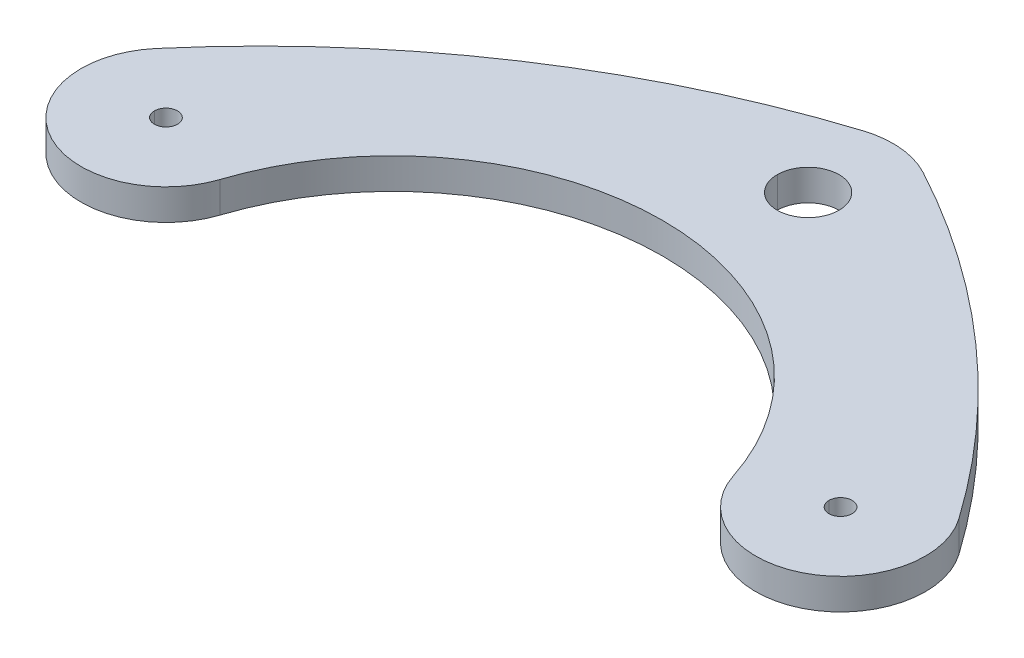
ISO-10303-21;
HEADER;
FILE_DESCRIPTION(('STEP AP214'),'2;1');
FILE_NAME('part.step','',(''),(''),'','','');
FILE_SCHEMA(('AUTOMOTIVE_DESIGN { 1 0 10303 214 1 1 1 1 }'));
ENDSEC;
DATA;
#1=APPLICATION_CONTEXT('core data for automotive mechanical design processes');
#2=APPLICATION_PROTOCOL_DEFINITION('international standard','automotive_design',2000,#1);
#3=PRODUCT_CONTEXT('',#1,'mechanical');
#4=PRODUCT('Part','Part','',(#3));
#5=PRODUCT_RELATED_PRODUCT_CATEGORY('part','',(#4));
#6=PRODUCT_DEFINITION_FORMATION('','',#4);
#7=PRODUCT_DEFINITION_CONTEXT('part definition',#1,'design');
#8=PRODUCT_DEFINITION('design','',#6,#7);
#9=PRODUCT_DEFINITION_SHAPE('','',#8);
#10=(LENGTH_UNIT() NAMED_UNIT(*) SI_UNIT(.MILLI.,.METRE.));
#11=(NAMED_UNIT(*) PLANE_ANGLE_UNIT() SI_UNIT($,.RADIAN.));
#12=(NAMED_UNIT(*) SI_UNIT($,.STERADIAN.) SOLID_ANGLE_UNIT());
#13=UNCERTAINTY_MEASURE_WITH_UNIT(LENGTH_MEASURE(1.E-05),#10,'distance_accuracy_value','');
#14=(GEOMETRIC_REPRESENTATION_CONTEXT(3) GLOBAL_UNCERTAINTY_ASSIGNED_CONTEXT((#13)) GLOBAL_UNIT_ASSIGNED_CONTEXT((#10,
#11,#12)) REPRESENTATION_CONTEXT('',''));
#15=CARTESIAN_POINT('',(0.,0.,0.));
#16=DIRECTION('',(0.,0.,1.));
#17=DIRECTION('',(1.,0.,0.));
#18=AXIS2_PLACEMENT_3D('',#15,#16,#17);
#19=CARTESIAN_POINT('',(24.1341268046564,-14.6000000000352,33.3708932983595));
#20=DIRECTION('',(3.23999160833921E-12,-1.,8.97471333360938E-13));
#21=DIRECTION('',(0.,-8.97471333360938E-13,-1.));
#22=AXIS2_PLACEMENT_3D('',#19,#20,#21);
#23=PLANE('',#22);
#24=CARTESIAN_POINT('',(87.3999999999932,-14.5999999998435,18.5999999999982));
#25=DIRECTION('',(3.24046345312468E-12,-1.,8.97471333360938E-13));
#26=DIRECTION('',(1.,3.24046345312468E-12,0.));
#27=AXIS2_PLACEMENT_3D('',#24,#25,#26);
#28=CIRCLE('',#27,1.5);
#29=CARTESIAN_POINT('',(85.8999999999932,-14.5999999998483,18.6));
#30=VERTEX_POINT('',#29);
#31=CARTESIAN_POINT('',(88.8999999999932,-14.5999999998386,18.6));
#32=VERTEX_POINT('',#31);
#33=EDGE_CURVE('E268',#30,#32,#28,.T.);
#34=ORIENTED_EDGE('',*,*,#33,.T.);
#35=CARTESIAN_POINT('',(87.3999999999932,-14.5999999998435,18.5999999999982));
#36=DIRECTION('',(3.24046345312468E-12,-1.,8.97471333360938E-13));
#37=DIRECTION('',(1.,3.24046345312468E-12,0.));
#38=AXIS2_PLACEMENT_3D('',#35,#36,#37);
#39=CIRCLE('',#38,1.5);
#40=EDGE_CURVE('E11',#32,#30,#39,.T.);
#41=ORIENTED_EDGE('',*,*,#40,.T.);
#42=EDGE_LOOP('',(#34,#41));
#43=FACE_BOUND('',#42,.T.);
#44=CARTESIAN_POINT('',(49.9999999999932,-14.5999999999944,-14.6000000000017));
#45=DIRECTION('',(3.24002977225569E-12,-1.,8.97471333360938E-13));
#46=DIRECTION('',(1.,3.24002977225569E-12,0.));
#47=AXIS2_PLACEMENT_3D('',#44,#45,#46);
#48=CIRCLE('',#47,4.);
#49=CARTESIAN_POINT('',(45.9999999999932,-14.6000000000074,-14.6));
#50=VERTEX_POINT('',#49);
#51=CARTESIAN_POINT('',(53.9999999999932,-14.5999999999815,-14.6));
#52=VERTEX_POINT('',#51);
#53=EDGE_CURVE('E180',#50,#52,#48,.T.);
#54=ORIENTED_EDGE('',*,*,#53,.T.);
#55=CARTESIAN_POINT('',(49.9999999999932,-14.5999999999944,-14.6000000000017));
#56=DIRECTION('',(3.24002977225569E-12,-1.,8.97471333360938E-13));
#57=DIRECTION('',(1.,3.24002977225569E-12,0.));
#58=AXIS2_PLACEMENT_3D('',#55,#56,#57);
#59=CIRCLE('',#58,4.);
#60=EDGE_CURVE('E172',#52,#50,#59,.T.);
#61=ORIENTED_EDGE('',*,*,#60,.T.);
#62=EDGE_LOOP('',(#54,#61));
#63=FACE_BOUND('',#62,.T.);
#64=CARTESIAN_POINT('',(-6.78623823802127E-12,-14.6000000001266,18.5999999999982));
#65=DIRECTION('',(3.24046345312468E-12,-1.,8.97471333360938E-13));
#66=DIRECTION('',(1.,3.24046345312468E-12,0.));
#67=AXIS2_PLACEMENT_3D('',#64,#65,#66);
#68=CIRCLE('',#67,1.5);
#69=CARTESIAN_POINT('',(-1.50000000000679,-14.6000000001315,18.6));
#70=VERTEX_POINT('',#69);
#71=CARTESIAN_POINT('',(1.49999999999321,-14.6000000001218,18.6));
#72=VERTEX_POINT('',#71);
#73=EDGE_CURVE('E242',#70,#72,#68,.T.);
#74=ORIENTED_EDGE('',*,*,#73,.T.);
#75=CARTESIAN_POINT('',(-6.78623823802127E-12,-14.6000000001266,18.5999999999982));
#76=DIRECTION('',(3.24046345312468E-12,-1.,8.97471333360938E-13));
#77=DIRECTION('',(1.,3.24046345312468E-12,0.));
#78=AXIS2_PLACEMENT_3D('',#75,#76,#77);
#79=CIRCLE('',#78,1.5);
#80=EDGE_CURVE('E178',#72,#70,#79,.T.);
#81=ORIENTED_EDGE('',*,*,#80,.T.);
#82=EDGE_LOOP('',(#74,#81));
#83=FACE_BOUND('',#82,.T.);
#84=CARTESIAN_POINT('',(49.9999999999932,-14.5999999999944,-14.6000000000017));
#85=DIRECTION('',(3.23999034672214E-12,-1.,8.97471333360938E-13));
#86=DIRECTION('',(1.,3.23999034672214E-12,0.));
#87=AXIS2_PLACEMENT_3D('',#84,#85,#86);
#88=CIRCLE('',#87,11.);
#89=CARTESIAN_POINT('',(46.6733135475964,-14.6000000000146,-25.0849013942658));
#90=VERTEX_POINT('',#89);
#91=CARTESIAN_POINT('',(55.2206349568502,-14.5999999999862,-24.2821986473774));
#92=VERTEX_POINT('',#91);
#93=EDGE_CURVE('E195',#90,#92,#88,.T.);
#94=ORIENTED_EDGE('',*,*,#93,.F.);
#95=CARTESIAN_POINT('',(82.9644384828343,-14.5999999997944,89.2958410886144));
#96=DIRECTION('',(3.23998640416878E-12,-1.,8.97471333360938E-13));
#97=DIRECTION('',(1.,3.23998640416878E-12,0.));
#98=AXIS2_PLACEMENT_3D('',#95,#96,#97);
#99=CIRCLE('',#98,120.);
#100=CARTESIAN_POINT('',(-8.37255801203662,-14.6000000001602,11.4655573213306));
#101=VERTEX_POINT('',#100);
#102=EDGE_CURVE('E203',#101,#90,#99,.T.);
#103=ORIENTED_EDGE('',*,*,#102,.F.);
#104=CARTESIAN_POINT('',(-6.78623823802127E-12,-14.6000000001266,18.5999999999982));
#105=DIRECTION('',(3.23999034672214E-12,-1.,8.97471333360938E-13));
#106=DIRECTION('',(1.,3.23999034672213E-12,0.));
#107=AXIS2_PLACEMENT_3D('',#104,#105,#106);
#108=CIRCLE('',#107,11.);
#109=CARTESIAN_POINT('',(-11.0000000000068,-14.6000000001623,18.6));
#110=VERTEX_POINT('',#109);
#111=EDGE_CURVE('E190',#110,#101,#108,.T.);
#112=ORIENTED_EDGE('',*,*,#111,.F.);
#113=CARTESIAN_POINT('',(-6.78623823802127E-12,-14.6000000001266,18.5999999999982));
#114=DIRECTION('',(3.23999034672214E-12,-1.,8.97471333360938E-13));
#115=DIRECTION('',(1.,3.23999034672213E-12,0.));
#116=AXIS2_PLACEMENT_3D('',#113,#114,#115);
#117=CIRCLE('',#116,11.);
#118=CARTESIAN_POINT('',(10.4499999999932,-14.6000000000897,22.0347488991173));
#119=VERTEX_POINT('',#118);
#120=EDGE_CURVE('E54',#119,#110,#117,.T.);
#121=ORIENTED_EDGE('',*,*,#120,.F.);
#122=CARTESIAN_POINT('',(43.6999999999932,-14.5999999999722,32.9634953963145));
#123=DIRECTION('',(-3.23996781784583E-12,1.,-8.97471333360938E-13));
#124=DIRECTION('',(1.,3.23996781784583E-12,0.));
#125=AXIS2_PLACEMENT_3D('',#122,#123,#124);
#126=CIRCLE('',#125,35.);
#127=CARTESIAN_POINT('',(76.9499999999932,-14.5999999998742,22.0347488991173));
#128=VERTEX_POINT('',#127);
#129=EDGE_CURVE('E135',#128,#119,#126,.T.);
#130=ORIENTED_EDGE('',*,*,#129,.F.);
#131=CARTESIAN_POINT('',(87.3999999999932,-14.5999999998435,18.5999999999982));
#132=DIRECTION('',(3.23999034672214E-12,-1.,8.97471333360938E-13));
#133=DIRECTION('',(1.,3.23999034672214E-12,0.));
#134=AXIS2_PLACEMENT_3D('',#131,#132,#133);
#135=CIRCLE('',#134,11.);
#136=CARTESIAN_POINT('',(96.3949468834557,-14.59999999982,12.2682600682189));
#137=VERTEX_POINT('',#136);
#138=EDGE_CURVE('E128',#137,#128,#135,.T.);
#139=ORIENTED_EDGE('',*,*,#138,.F.);
#140=CARTESIAN_POINT('',(-1.73174639068027,-14.6000000000759,81.3417865967207));
#141=DIRECTION('',(3.23998640416879E-12,-1.,8.97471333360938E-13));
#142=DIRECTION('',(1.,3.23998640416879E-12,0.));
#143=AXIS2_PLACEMENT_3D('',#140,#141,#142);
#144=CIRCLE('',#143,120.);
#145=EDGE_CURVE('E132',#92,#137,#144,.T.);
#146=ORIENTED_EDGE('',*,*,#145,.F.);
#147=EDGE_LOOP('',(#94,#103,#112,#121,#130,#139,#146));
#148=FACE_BOUND('',#147,.T.);
#149=ADVANCED_FACE('F16',(#43,#63,#83,#148),#23,.F.);
#150=CARTESIAN_POINT('',(24.1341268046694,-18.6000000000352,33.3708932983631));
#151=DIRECTION('',(3.23999160833921E-12,-1.,8.97471333360938E-13));
#152=DIRECTION('',(0.,-8.97471333360938E-13,-1.));
#153=AXIS2_PLACEMENT_3D('',#150,#151,#152);
#154=PLANE('',#153);
#155=CARTESIAN_POINT('',(87.4000000000062,-18.5999999998435,18.6000000000018));
#156=DIRECTION('',(3.24046345312468E-12,-1.,8.97471333360938E-13));
#157=DIRECTION('',(1.,3.24046345312468E-12,0.));
#158=AXIS2_PLACEMENT_3D('',#155,#156,#157);
#159=CIRCLE('',#158,1.5);
#160=CARTESIAN_POINT('',(85.9000000000062,-18.5999999998484,18.6));
#161=VERTEX_POINT('',#160);
#162=CARTESIAN_POINT('',(88.9000000000062,-18.5999999998386,18.6));
#163=VERTEX_POINT('',#162);
#164=EDGE_CURVE('E217',#161,#163,#159,.T.);
#165=ORIENTED_EDGE('',*,*,#164,.F.);
#166=CARTESIAN_POINT('',(87.4000000000062,-18.5999999998435,18.6000000000018));
#167=DIRECTION('',(3.24046345312468E-12,-1.,8.97471333360938E-13));
#168=DIRECTION('',(1.,3.24046345312468E-12,0.));
#169=AXIS2_PLACEMENT_3D('',#166,#167,#168);
#170=CIRCLE('',#169,1.5);
#171=EDGE_CURVE('E26',#163,#161,#170,.T.);
#172=ORIENTED_EDGE('',*,*,#171,.F.);
#173=EDGE_LOOP('',(#165,#172));
#174=FACE_BOUND('',#173,.T.);
#175=CARTESIAN_POINT('',(50.0000000000062,-18.5999999999945,-14.5999999999981));
#176=DIRECTION('',(3.23959609138669E-12,-1.,8.97471333360938E-13));
#177=DIRECTION('',(1.,3.23959609138669E-12,0.));
#178=AXIS2_PLACEMENT_3D('',#175,#176,#177);
#179=CIRCLE('',#178,4.);
#180=CARTESIAN_POINT('',(46.0000000000062,-18.6000000000074,-14.6));
#181=VERTEX_POINT('',#180);
#182=CARTESIAN_POINT('',(54.0000000000062,-18.5999999999815,-14.6));
#183=VERTEX_POINT('',#182);
#184=EDGE_CURVE('E261',#181,#183,#179,.T.);
#185=ORIENTED_EDGE('',*,*,#184,.F.);
#186=CARTESIAN_POINT('',(50.0000000000062,-18.5999999999945,-14.5999999999981));
#187=DIRECTION('',(3.23959609138669E-12,-1.,8.97471333360938E-13));
#188=DIRECTION('',(1.,3.23959609138669E-12,0.));
#189=AXIS2_PLACEMENT_3D('',#186,#187,#188);
#190=CIRCLE('',#189,4.);
#191=EDGE_CURVE('E176',#183,#181,#190,.T.);
#192=ORIENTED_EDGE('',*,*,#191,.F.);
#193=EDGE_LOOP('',(#185,#192));
#194=FACE_BOUND('',#193,.T.);
#195=CARTESIAN_POINT('',(6.17383921763803E-12,-18.6000000001266,18.6000000000018));
#196=DIRECTION('',(3.24046345312468E-12,-1.,8.97471333360938E-13));
#197=DIRECTION('',(1.,3.24046345312468E-12,0.));
#198=AXIS2_PLACEMENT_3D('',#195,#196,#197);
#199=CIRCLE('',#198,1.5);
#200=CARTESIAN_POINT('',(-1.49999999999383,-18.6000000001315,18.6));
#201=VERTEX_POINT('',#200);
#202=CARTESIAN_POINT('',(1.50000000000618,-18.6000000001218,18.6));
#203=VERTEX_POINT('',#202);
#204=EDGE_CURVE('E222',#201,#203,#199,.T.);
#205=ORIENTED_EDGE('',*,*,#204,.F.);
#206=CARTESIAN_POINT('',(6.17383921763803E-12,-18.6000000001266,18.6000000000018));
#207=DIRECTION('',(3.24046345312468E-12,-1.,8.97471333360938E-13));
#208=DIRECTION('',(1.,3.24046345312468E-12,0.));
#209=AXIS2_PLACEMENT_3D('',#206,#207,#208);
#210=CIRCLE('',#209,1.5);
#211=EDGE_CURVE('E175',#203,#201,#210,.T.);
#212=ORIENTED_EDGE('',*,*,#211,.F.);
#213=EDGE_LOOP('',(#205,#212));
#214=FACE_BOUND('',#213,.T.);
#215=CARTESIAN_POINT('',(50.0000000000062,-18.5999999999945,-14.5999999999981));
#216=DIRECTION('',(3.24014804885632E-12,-1.,8.97471333360938E-13));
#217=DIRECTION('',(1.,3.24014804885632E-12,0.));
#218=AXIS2_PLACEMENT_3D('',#215,#216,#217);
#219=CIRCLE('',#218,11.);
#220=CARTESIAN_POINT('',(46.6733135476094,-18.6000000000146,-25.0849013942622));
#221=VERTEX_POINT('',#220);
#222=CARTESIAN_POINT('',(55.2206349568632,-18.5999999999862,-24.2821986473738));
#223=VERTEX_POINT('',#222);
#224=EDGE_CURVE('E164',#221,#223,#219,.T.);
#225=ORIENTED_EDGE('',*,*,#224,.T.);
#226=CARTESIAN_POINT('',(-1.7317463906673,-18.6000000000759,81.3417865967243));
#227=DIRECTION('',(3.24000086019775E-12,-1.,8.97471333360938E-13));
#228=DIRECTION('',(1.,3.24000086019775E-12,0.));
#229=AXIS2_PLACEMENT_3D('',#226,#227,#228);
#230=CIRCLE('',#229,120.);
#231=CARTESIAN_POINT('',(96.3949468834687,-18.59999999982,12.2682600682225));
#232=VERTEX_POINT('',#231);
#233=EDGE_CURVE('E141',#223,#232,#230,.T.);
#234=ORIENTED_EDGE('',*,*,#233,.T.);
#235=CARTESIAN_POINT('',(87.4000000000062,-18.5999999998435,18.6000000000018));
#236=DIRECTION('',(3.24014804885632E-12,-1.,8.97471333360938E-13));
#237=DIRECTION('',(1.,3.24014804885632E-12,0.));
#238=AXIS2_PLACEMENT_3D('',#235,#236,#237);
#239=CIRCLE('',#238,11.);
#240=CARTESIAN_POINT('',(76.9500000000062,-18.5999999998743,22.034748899121));
#241=VERTEX_POINT('',#240);
#242=EDGE_CURVE('E147',#232,#241,#239,.T.);
#243=ORIENTED_EDGE('',*,*,#242,.T.);
#244=CARTESIAN_POINT('',(43.7000000000061,-18.5999999999722,32.9634953963181));
#245=DIRECTION('',(-3.23996781784583E-12,1.,-8.97471333360938E-13));
#246=DIRECTION('',(1.,3.23996781784583E-12,0.));
#247=AXIS2_PLACEMENT_3D('',#244,#245,#246);
#248=CIRCLE('',#247,35.);
#249=CARTESIAN_POINT('',(10.4500000000062,-18.6000000000897,22.034748899121));
#250=VERTEX_POINT('',#249);
#251=EDGE_CURVE('E171',#241,#250,#248,.T.);
#252=ORIENTED_EDGE('',*,*,#251,.T.);
#253=CARTESIAN_POINT('',(6.17383921763803E-12,-18.6000000001266,18.6000000000018));
#254=DIRECTION('',(3.24014804885632E-12,-1.,8.97471333360938E-13));
#255=DIRECTION('',(1.,3.24014804885632E-12,0.));
#256=AXIS2_PLACEMENT_3D('',#253,#254,#255);
#257=CIRCLE('',#256,11.);
#258=CARTESIAN_POINT('',(-10.9999999999938,-18.6000000001623,18.6));
#259=VERTEX_POINT('',#258);
#260=EDGE_CURVE('E40',#250,#259,#257,.T.);
#261=ORIENTED_EDGE('',*,*,#260,.T.);
#262=CARTESIAN_POINT('',(6.17383921763803E-12,-18.6000000001266,18.6000000000018));
#263=DIRECTION('',(3.24014804885632E-12,-1.,8.97471333360938E-13));
#264=DIRECTION('',(1.,3.24014804885632E-12,0.));
#265=AXIS2_PLACEMENT_3D('',#262,#263,#264);
#266=CIRCLE('',#265,11.);
#267=CARTESIAN_POINT('',(-8.37255801202366,-18.6000000001601,11.4655573213342));
#268=VERTEX_POINT('',#267);
#269=EDGE_CURVE('E191',#259,#268,#266,.T.);
#270=ORIENTED_EDGE('',*,*,#269,.T.);
#271=CARTESIAN_POINT('',(82.9644384828473,-18.5999999997944,89.295841088618));
#272=DIRECTION('',(3.24000086019775E-12,-1.,8.97471333360938E-13));
#273=DIRECTION('',(1.,3.24000086019775E-12,0.));
#274=AXIS2_PLACEMENT_3D('',#271,#272,#273);
#275=CIRCLE('',#274,120.);
#276=EDGE_CURVE('E200',#268,#221,#275,.T.);
#277=ORIENTED_EDGE('',*,*,#276,.T.);
#278=EDGE_LOOP('',(#225,#234,#243,#252,#261,#270,#277));
#279=FACE_BOUND('',#278,.T.);
#280=ADVANCED_FACE('F283',(#174,#194,#214,#279),#154,.T.);
#281=CARTESIAN_POINT('',(87.4000000000062,-18.5999999998435,18.6000000000018));
#282=DIRECTION('',(-3.24046345312468E-12,1.,-8.97471333360938E-13));
#283=DIRECTION('',(-1.,-3.24046345312468E-12,0.));
#284=AXIS2_PLACEMENT_3D('',#281,#282,#283);
#285=CYLINDRICAL_SURFACE('',#284,1.5);
#286=DIRECTION('',(-3.24001936391482E-12,1.,-8.97471333360938E-13));
#287=VECTOR('',#286,1.);
#288=CARTESIAN_POINT('',(88.9000000000062,-18.5999999998386,18.6000000000018));
#289=LINE('',#288,#287);
#290=EDGE_CURVE('E221',#163,#32,#289,.T.);
#291=ORIENTED_EDGE('',*,*,#290,.F.);
#292=ORIENTED_EDGE('',*,*,#171,.T.);
#293=DIRECTION('',(-3.24001936391482E-12,1.,-8.97471333360938E-13));
#294=VECTOR('',#293,1.);
#295=CARTESIAN_POINT('',(85.9000000000062,-18.5999999998484,18.6000000000018));
#296=LINE('',#295,#294);
#297=EDGE_CURVE('E20',#161,#30,#296,.T.);
#298=ORIENTED_EDGE('',*,*,#297,.T.);
#299=ORIENTED_EDGE('',*,*,#40,.F.);
#300=EDGE_LOOP('',(#291,#292,#298,#299));
#301=FACE_BOUND('',#300,.T.);
#302=ADVANCED_FACE('F18',(#301),#285,.F.);
#303=CARTESIAN_POINT('',(82.9644384828473,-18.5999999997944,89.295841088618));
#304=DIRECTION('',(-3.24000086019775E-12,1.,-8.97471333360938E-13));
#305=DIRECTION('',(-1.,-3.24000086019775E-12,0.));
#306=AXIS2_PLACEMENT_3D('',#303,#304,#305);
#307=CYLINDRICAL_SURFACE('',#306,120.);
#308=ORIENTED_EDGE('',*,*,#102,.T.);
#309=DIRECTION('',(-3.24001936391482E-12,1.,-8.97471333360938E-13));
#310=VECTOR('',#309,1.);
#311=CARTESIAN_POINT('',(46.6733135476094,-18.6000000000146,-25.0849013942622));
#312=LINE('',#311,#310);
#313=EDGE_CURVE('E157',#221,#90,#312,.T.);
#314=ORIENTED_EDGE('',*,*,#313,.F.);
#315=ORIENTED_EDGE('',*,*,#276,.F.);
#316=DIRECTION('',(-3.24001936391482E-12,1.,-8.97471333360938E-13));
#317=VECTOR('',#316,1.);
#318=CARTESIAN_POINT('',(-8.37255801202366,-18.6000000001601,11.4655573213342));
#319=LINE('',#318,#317);
#320=EDGE_CURVE('E192',#268,#101,#319,.T.);
#321=ORIENTED_EDGE('',*,*,#320,.T.);
#322=EDGE_LOOP('',(#308,#314,#315,#321));
#323=FACE_BOUND('',#322,.T.);
#324=ADVANCED_FACE('F292',(#323),#307,.T.);
#325=CARTESIAN_POINT('',(6.17383921763803E-12,-18.6000000001266,18.6000000000018));
#326=DIRECTION('',(-3.24046345312468E-12,1.,-8.97471333360938E-13));
#327=DIRECTION('',(-1.,-3.24046345312468E-12,0.));
#328=AXIS2_PLACEMENT_3D('',#325,#326,#327);
#329=CYLINDRICAL_SURFACE('',#328,1.5);
#330=DIRECTION('',(-3.24001936391482E-12,1.,-8.97471333360938E-13));
#331=VECTOR('',#330,1.);
#332=CARTESIAN_POINT('',(1.50000000000618,-18.6000000001218,18.6000000000018));
#333=LINE('',#332,#331);
#334=EDGE_CURVE('E225',#203,#72,#333,.T.);
#335=ORIENTED_EDGE('',*,*,#334,.F.);
#336=ORIENTED_EDGE('',*,*,#211,.T.);
#337=DIRECTION('',(-3.24001936391482E-12,1.,-8.97471333360938E-13));
#338=VECTOR('',#337,1.);
#339=CARTESIAN_POINT('',(-1.49999999999383,-18.6000000001315,18.6000000000018));
#340=LINE('',#339,#338);
#341=EDGE_CURVE('E168',#201,#70,#340,.T.);
#342=ORIENTED_EDGE('',*,*,#341,.T.);
#343=ORIENTED_EDGE('',*,*,#80,.F.);
#344=EDGE_LOOP('',(#335,#336,#342,#343));
#345=FACE_BOUND('',#344,.T.);
#346=ADVANCED_FACE('F309',(#345),#329,.F.);
#347=CARTESIAN_POINT('',(50.0000000000062,-18.5999999999945,-14.5999999999981));
#348=DIRECTION('',(-3.23959609138669E-12,1.,-8.97471333360938E-13));
#349=DIRECTION('',(-1.,-3.23959609138669E-12,0.));
#350=AXIS2_PLACEMENT_3D('',#347,#348,#349);
#351=CYLINDRICAL_SURFACE('',#350,4.);
#352=DIRECTION('',(-3.24001936391482E-12,1.,-8.97471333360938E-13));
#353=VECTOR('',#352,1.);
#354=CARTESIAN_POINT('',(54.0000000000062,-18.5999999999815,-14.5999999999981));
#355=LINE('',#354,#353);
#356=EDGE_CURVE('E185',#183,#52,#355,.T.);
#357=ORIENTED_EDGE('',*,*,#356,.F.);
#358=ORIENTED_EDGE('',*,*,#191,.T.);
#359=DIRECTION('',(-3.24001936391482E-12,1.,-8.97471333360938E-13));
#360=VECTOR('',#359,1.);
#361=CARTESIAN_POINT('',(46.0000000000062,-18.6000000000074,-14.5999999999981));
#362=LINE('',#361,#360);
#363=EDGE_CURVE('E184',#181,#50,#362,.T.);
#364=ORIENTED_EDGE('',*,*,#363,.T.);
#365=ORIENTED_EDGE('',*,*,#60,.F.);
#366=EDGE_LOOP('',(#357,#358,#364,#365));
#367=FACE_BOUND('',#366,.T.);
#368=ADVANCED_FACE('F560',(#367),#351,.F.);
#369=CARTESIAN_POINT('',(6.17383921763803E-12,-18.6000000001266,18.6000000000018));
#370=DIRECTION('',(-3.24014804885632E-12,1.,-8.97471333360938E-13));
#371=DIRECTION('',(-1.,-3.24014804885632E-12,0.));
#372=AXIS2_PLACEMENT_3D('',#369,#370,#371);
#373=CYLINDRICAL_SURFACE('',#372,11.);
#374=DIRECTION('',(-3.24001936391482E-12,1.,-8.97471333360938E-13));
#375=VECTOR('',#374,1.);
#376=CARTESIAN_POINT('',(-10.9999999999938,-18.6000000001623,18.6000000000018));
#377=LINE('',#376,#375);
#378=EDGE_CURVE('E186',#259,#110,#377,.T.);
#379=ORIENTED_EDGE('',*,*,#378,.F.);
#380=ORIENTED_EDGE('',*,*,#260,.F.);
#381=DIRECTION('',(-3.24001936391482E-12,1.,-8.97471333360938E-13));
#382=VECTOR('',#381,1.);
#383=CARTESIAN_POINT('',(10.4500000000062,-18.6000000000897,22.034748899121));
#384=LINE('',#383,#382);
#385=EDGE_CURVE('E199',#250,#119,#384,.T.);
#386=ORIENTED_EDGE('',*,*,#385,.T.);
#387=ORIENTED_EDGE('',*,*,#120,.T.);
#388=EDGE_LOOP('',(#379,#380,#386,#387));
#389=FACE_BOUND('',#388,.T.);
#390=ADVANCED_FACE('F355',(#389),#373,.T.);
#391=CARTESIAN_POINT('',(43.7000000000061,-18.5999999999722,32.9634953963181));
#392=DIRECTION('',(-3.23996781784583E-12,1.,-8.97471333360938E-13));
#393=DIRECTION('',(-1.,-3.23996781784583E-12,0.));
#394=AXIS2_PLACEMENT_3D('',#391,#392,#393);
#395=CYLINDRICAL_SURFACE('',#394,35.);
#396=ORIENTED_EDGE('',*,*,#129,.T.);
#397=ORIENTED_EDGE('',*,*,#385,.F.);
#398=ORIENTED_EDGE('',*,*,#251,.F.);
#399=DIRECTION('',(-3.24001936391482E-12,1.,-8.97471333360938E-13));
#400=VECTOR('',#399,1.);
#401=CARTESIAN_POINT('',(76.9500000000062,-18.5999999998743,22.034748899121));
#402=LINE('',#401,#400);
#403=EDGE_CURVE('E140',#241,#128,#402,.T.);
#404=ORIENTED_EDGE('',*,*,#403,.T.);
#405=EDGE_LOOP('',(#396,#397,#398,#404));
#406=FACE_BOUND('',#405,.T.);
#407=ADVANCED_FACE('F281',(#406),#395,.F.);
#408=CARTESIAN_POINT('',(87.4000000000062,-18.5999999998435,18.6000000000018));
#409=DIRECTION('',(-3.24014804885632E-12,1.,-8.97471333360938E-13));
#410=DIRECTION('',(-1.,-3.24014804885632E-12,0.));
#411=AXIS2_PLACEMENT_3D('',#408,#409,#410);
#412=CYLINDRICAL_SURFACE('',#411,11.);
#413=ORIENTED_EDGE('',*,*,#138,.T.);
#414=ORIENTED_EDGE('',*,*,#403,.F.);
#415=ORIENTED_EDGE('',*,*,#242,.F.);
#416=DIRECTION('',(-3.24001936391482E-12,1.,-8.97471333360938E-13));
#417=VECTOR('',#416,1.);
#418=CARTESIAN_POINT('',(96.3949468834687,-18.59999999982,12.2682600682225));
#419=LINE('',#418,#417);
#420=EDGE_CURVE('E144',#232,#137,#419,.T.);
#421=ORIENTED_EDGE('',*,*,#420,.T.);
#422=EDGE_LOOP('',(#413,#414,#415,#421));
#423=FACE_BOUND('',#422,.T.);
#424=ADVANCED_FACE('F145',(#423),#412,.T.);
#425=CARTESIAN_POINT('',(-1.7317463906673,-18.6000000000759,81.3417865967243));
#426=DIRECTION('',(-3.24000086019775E-12,1.,-8.97471333360938E-13));
#427=DIRECTION('',(-1.,-3.24000086019775E-12,0.));
#428=AXIS2_PLACEMENT_3D('',#425,#426,#427);
#429=CYLINDRICAL_SURFACE('',#428,120.);
#430=ORIENTED_EDGE('',*,*,#145,.T.);
#431=ORIENTED_EDGE('',*,*,#420,.F.);
#432=ORIENTED_EDGE('',*,*,#233,.F.);
#433=DIRECTION('',(-3.24001936391482E-12,1.,-8.97471333360938E-13));
#434=VECTOR('',#433,1.);
#435=CARTESIAN_POINT('',(55.2206349568632,-18.5999999999862,-24.2821986473738));
#436=LINE('',#435,#434);
#437=EDGE_CURVE('E154',#223,#92,#436,.T.);
#438=ORIENTED_EDGE('',*,*,#437,.T.);
#439=EDGE_LOOP('',(#430,#431,#432,#438));
#440=FACE_BOUND('',#439,.T.);
#441=ADVANCED_FACE('F152',(#440),#429,.T.);
#442=CARTESIAN_POINT('',(50.0000000000062,-18.5999999999945,-14.5999999999981));
#443=DIRECTION('',(-3.24014804885632E-12,1.,-8.97471333360938E-13));
#444=DIRECTION('',(-1.,-3.24014804885632E-12,0.));
#445=AXIS2_PLACEMENT_3D('',#442,#443,#444);
#446=CYLINDRICAL_SURFACE('',#445,11.);
#447=ORIENTED_EDGE('',*,*,#93,.T.);
#448=ORIENTED_EDGE('',*,*,#437,.F.);
#449=ORIENTED_EDGE('',*,*,#224,.F.);
#450=ORIENTED_EDGE('',*,*,#313,.T.);
#451=EDGE_LOOP('',(#447,#448,#449,#450));
#452=FACE_BOUND('',#451,.T.);
#453=ADVANCED_FACE('F302',(#452),#446,.T.);
#454=CARTESIAN_POINT('',(6.17383921763803E-12,-18.6000000001266,18.6000000000018));
#455=DIRECTION('',(-3.24014804885632E-12,1.,-8.97471333360938E-13));
#456=DIRECTION('',(-1.,-3.24014804885632E-12,0.));
#457=AXIS2_PLACEMENT_3D('',#454,#455,#456);
#458=CYLINDRICAL_SURFACE('',#457,11.);
#459=ORIENTED_EDGE('',*,*,#269,.F.);
#460=ORIENTED_EDGE('',*,*,#378,.T.);
#461=ORIENTED_EDGE('',*,*,#111,.T.);
#462=ORIENTED_EDGE('',*,*,#320,.F.);
#463=EDGE_LOOP('',(#459,#460,#461,#462));
#464=FACE_BOUND('',#463,.T.);
#465=ADVANCED_FACE('F305',(#464),#458,.T.);
#466=CARTESIAN_POINT('',(50.0000000000062,-18.5999999999945,-14.5999999999981));
#467=DIRECTION('',(-3.23959609138669E-12,1.,-8.97471333360938E-13));
#468=DIRECTION('',(-1.,-3.23959609138669E-12,0.));
#469=AXIS2_PLACEMENT_3D('',#466,#467,#468);
#470=CYLINDRICAL_SURFACE('',#469,4.);
#471=ORIENTED_EDGE('',*,*,#184,.T.);
#472=ORIENTED_EDGE('',*,*,#356,.T.);
#473=ORIENTED_EDGE('',*,*,#53,.F.);
#474=ORIENTED_EDGE('',*,*,#363,.F.);
#475=EDGE_LOOP('',(#471,#472,#473,#474));
#476=FACE_BOUND('',#475,.T.);
#477=ADVANCED_FACE('F300',(#476),#470,.F.);
#478=CARTESIAN_POINT('',(6.17383921763803E-12,-18.6000000001266,18.6000000000018));
#479=DIRECTION('',(-3.24046345312468E-12,1.,-8.97471333360938E-13));
#480=DIRECTION('',(-1.,-3.24046345312468E-12,0.));
#481=AXIS2_PLACEMENT_3D('',#478,#479,#480);
#482=CYLINDRICAL_SURFACE('',#481,1.5);
#483=ORIENTED_EDGE('',*,*,#204,.T.);
#484=ORIENTED_EDGE('',*,*,#334,.T.);
#485=ORIENTED_EDGE('',*,*,#73,.F.);
#486=ORIENTED_EDGE('',*,*,#341,.F.);
#487=EDGE_LOOP('',(#483,#484,#485,#486));
#488=FACE_BOUND('',#487,.T.);
#489=ADVANCED_FACE('F313',(#488),#482,.F.);
#490=CARTESIAN_POINT('',(87.4000000000062,-18.5999999998435,18.6000000000018));
#491=DIRECTION('',(-3.24046345312468E-12,1.,-8.97471333360938E-13));
#492=DIRECTION('',(-1.,-3.24046345312468E-12,0.));
#493=AXIS2_PLACEMENT_3D('',#490,#491,#492);
#494=CYLINDRICAL_SURFACE('',#493,1.5);
#495=ORIENTED_EDGE('',*,*,#164,.T.);
#496=ORIENTED_EDGE('',*,*,#290,.T.);
#497=ORIENTED_EDGE('',*,*,#33,.F.);
#498=ORIENTED_EDGE('',*,*,#297,.F.);
#499=EDGE_LOOP('',(#495,#496,#497,#498));
#500=FACE_BOUND('',#499,.T.);
#501=ADVANCED_FACE('F315',(#500),#494,.F.);
#502=CLOSED_SHELL('',(#149,#280,#302,#324,#346,#368,#390,#407,#424,#441,#453,#465,#477,#489,#501));
#503=MANIFOLD_SOLID_BREP('B1',#502);
#504=ADVANCED_BREP_SHAPE_REPRESENTATION('',(#18,#503),#14);
#505=SHAPE_DEFINITION_REPRESENTATION(#9,#504);
ENDSEC;
END-ISO-10303-21;
